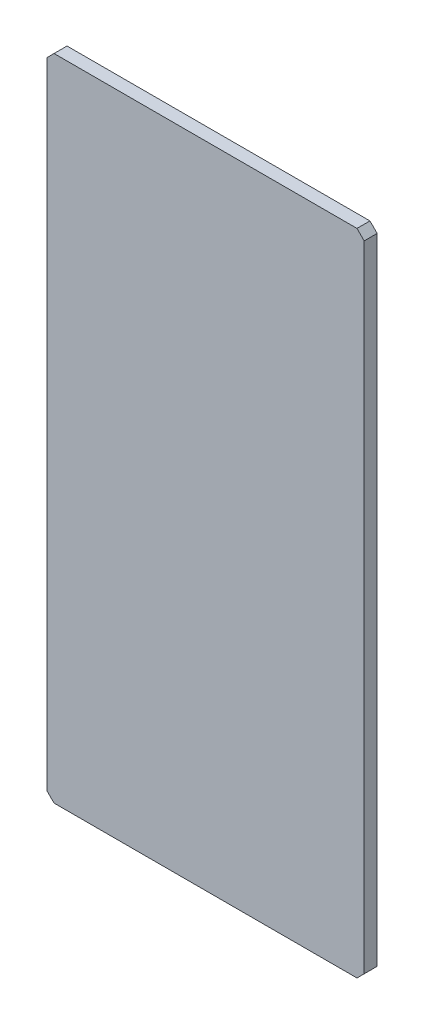
ISO-10303-21;
HEADER;
FILE_DESCRIPTION(('STEP AP214'),'2;1');
FILE_NAME('part.step','',(''),(''),'','','');
FILE_SCHEMA(('AUTOMOTIVE_DESIGN { 1 0 10303 214 1 1 1 1 }'));
ENDSEC;
DATA;
#1=APPLICATION_CONTEXT('core data for automotive mechanical design processes');
#2=APPLICATION_PROTOCOL_DEFINITION('international standard','automotive_design',2000,#1);
#3=PRODUCT_CONTEXT('',#1,'mechanical');
#4=PRODUCT('Part','Part','',(#3));
#5=PRODUCT_RELATED_PRODUCT_CATEGORY('part','',(#4));
#6=PRODUCT_DEFINITION_FORMATION('','',#4);
#7=PRODUCT_DEFINITION_CONTEXT('part definition',#1,'design');
#8=PRODUCT_DEFINITION('design','',#6,#7);
#9=PRODUCT_DEFINITION_SHAPE('','',#8);
#10=(LENGTH_UNIT() NAMED_UNIT(*) SI_UNIT(.MILLI.,.METRE.));
#11=(NAMED_UNIT(*) PLANE_ANGLE_UNIT() SI_UNIT($,.RADIAN.));
#12=(NAMED_UNIT(*) SI_UNIT($,.STERADIAN.) SOLID_ANGLE_UNIT());
#13=UNCERTAINTY_MEASURE_WITH_UNIT(LENGTH_MEASURE(1.E-05),#10,'distance_accuracy_value','');
#14=(GEOMETRIC_REPRESENTATION_CONTEXT(3) GLOBAL_UNCERTAINTY_ASSIGNED_CONTEXT((#13)) GLOBAL_UNIT_ASSIGNED_CONTEXT((#10,
#11,#12)) REPRESENTATION_CONTEXT('',''));
#15=CARTESIAN_POINT('',(0.,0.,0.));
#16=DIRECTION('',(0.,0.,1.));
#17=DIRECTION('',(1.,0.,0.));
#18=AXIS2_PLACEMENT_3D('',#15,#16,#17);
#19=CARTESIAN_POINT('',(1.61648472385423E-12,343.,-83.0000000000048));
#20=DIRECTION('',(0.,0.,-1.));
#21=DIRECTION('',(-1.,0.,0.));
#22=AXIS2_PLACEMENT_3D('',#19,#20,#21);
#23=PLANE('',#22);
#24=DIRECTION('',(0.707106781186547,-0.707106781186548,0.));
#25=VECTOR('',#24,1.);
#26=CARTESIAN_POINT('',(-214.999999999998,-4.99999999999926,-83.000000000023));
#27=LINE('',#26,#25);
#28=CARTESIAN_POINT('',(-219.999999999998,1.86283280467771E-13,-83.000000000023));
#29=VERTEX_POINT('',#28);
#30=CARTESIAN_POINT('',(-209.999999999998,-9.99999999999993,-83.0000000000224));
#31=VERTEX_POINT('',#30);
#32=EDGE_CURVE('E113',#29,#31,#27,.T.);
#33=ORIENTED_EDGE('',*,*,#32,.F.);
#34=DIRECTION('',(0.,1.,0.));
#35=VECTOR('',#34,1.);
#36=CARTESIAN_POINT('',(-219.999999999997,40.,-83.000000000023));
#37=LINE('',#36,#35);
#38=CARTESIAN_POINT('',(-219.999999999998,880.,-83.0000000000228));
#39=VERTEX_POINT('',#38);
#40=EDGE_CURVE('E117',#39,#29,#37,.F.);
#41=ORIENTED_EDGE('',*,*,#40,.F.);
#42=DIRECTION('',(-0.707106781186548,-0.707106781186548,0.));
#43=VECTOR('',#42,1.);
#44=CARTESIAN_POINT('',(-214.999999999998,884.999999999999,-83.0000000000222));
#45=LINE('',#44,#43);
#46=CARTESIAN_POINT('',(-209.999999999998,890.,-83.0000000000135));
#47=VERTEX_POINT('',#46);
#48=EDGE_CURVE('E94',#47,#39,#45,.T.);
#49=ORIENTED_EDGE('',*,*,#48,.F.);
#50=DIRECTION('',(1.,0.,0.));
#51=VECTOR('',#50,1.);
#52=CARTESIAN_POINT('',(-57.4999999999997,890.,-82.9999999999874));
#53=LINE('',#52,#51);
#54=CARTESIAN_POINT('',(210.000000000001,890.,-82.9999999999872));
#55=VERTEX_POINT('',#54);
#56=EDGE_CURVE('E19',#55,#47,#53,.F.);
#57=ORIENTED_EDGE('',*,*,#56,.F.);
#58=DIRECTION('',(-0.707106781186548,0.707106781186548,0.));
#59=VECTOR('',#58,1.);
#60=CARTESIAN_POINT('',(215.000000000001,885.000000000001,-82.9999999999865));
#61=LINE('',#60,#59);
#62=CARTESIAN_POINT('',(220.000000000001,880.,-82.9999999999866));
#63=VERTEX_POINT('',#62);
#64=EDGE_CURVE('E82',#63,#55,#61,.T.);
#65=ORIENTED_EDGE('',*,*,#64,.F.);
#66=DIRECTION('',(0.,1.,0.));
#67=VECTOR('',#66,1.);
#68=CARTESIAN_POINT('',(220.000000000002,648.,-82.9999999999865));
#69=LINE('',#68,#67);
#70=CARTESIAN_POINT('',(220.000000000001,-1.00956569493163E-13,-82.9999999999868));
#71=VERTEX_POINT('',#70);
#72=EDGE_CURVE('E77',#71,#63,#69,.T.);
#73=ORIENTED_EDGE('',*,*,#72,.F.);
#74=DIRECTION('',(0.707106781186547,0.707106781186548,0.));
#75=VECTOR('',#74,1.);
#76=CARTESIAN_POINT('',(215.000000000001,-5.00000000000075,-82.9999999999874));
#77=LINE('',#76,#75);
#78=CARTESIAN_POINT('',(210.000000000001,-10.0000000000002,-82.9999999999961));
#79=VERTEX_POINT('',#78);
#80=EDGE_CURVE('E105',#79,#71,#77,.T.);
#81=ORIENTED_EDGE('',*,*,#80,.F.);
#82=DIRECTION('',(1.,0.,0.));
#83=VECTOR('',#82,1.);
#84=CARTESIAN_POINT('',(57.5,-10.,-83.0000000000222));
#85=LINE('',#84,#83);
#86=EDGE_CURVE('E109',#31,#79,#85,.T.);
#87=ORIENTED_EDGE('',*,*,#86,.F.);
#88=EDGE_LOOP('',(#33,#41,#49,#57,#65,#73,#81,#87));
#89=FACE_BOUND('',#88,.T.);
#90=ADVANCED_FACE('F16',(#89),#23,.T.);
#91=CARTESIAN_POINT('',(-57.4999999999997,890.,-65.0000000000095));
#92=DIRECTION('',(0.,1.,0.));
#93=DIRECTION('',(0.,0.,1.));
#94=AXIS2_PLACEMENT_3D('',#91,#92,#93);
#95=PLANE('',#94);
#96=DIRECTION('',(0.,0.,1.));
#97=VECTOR('',#96,1.);
#98=CARTESIAN_POINT('',(210.,889.999999999999,-64.9999999999869));
#99=LINE('',#98,#97);
#100=CARTESIAN_POINT('',(210.,890.,-65.0000000000048));
#101=VERTEX_POINT('',#100);
#102=EDGE_CURVE('E87',#55,#101,#99,.T.);
#103=ORIENTED_EDGE('',*,*,#102,.F.);
#104=ORIENTED_EDGE('',*,*,#56,.T.);
#105=DIRECTION('',(0.,0.,1.));
#106=VECTOR('',#105,1.);
#107=CARTESIAN_POINT('',(-209.999999999999,890.,-65.0000000000226));
#108=LINE('',#107,#106);
#109=CARTESIAN_POINT('',(-209.999999999999,890.,-65.0000000000224));
#110=VERTEX_POINT('',#109);
#111=EDGE_CURVE('E123',#110,#47,#108,.F.);
#112=ORIENTED_EDGE('',*,*,#111,.F.);
#113=DIRECTION('',(-1.,0.,0.));
#114=VECTOR('',#113,1.);
#115=CARTESIAN_POINT('',(1.23572649697815E-13,890.,-65.0000000000048));
#116=LINE('',#115,#114);
#117=EDGE_CURVE('E100',#110,#101,#116,.F.);
#118=ORIENTED_EDGE('',*,*,#117,.T.);
#119=EDGE_LOOP('',(#103,#104,#112,#118));
#120=FACE_BOUND('',#119,.T.);
#121=ADVANCED_FACE('F99',(#120),#95,.T.);
#122=CARTESIAN_POINT('',(215.,885.,-64.9999999999869));
#123=DIRECTION('',(0.707106781186548,0.707106781186548,0.));
#124=DIRECTION('',(-0.707106781186548,0.707106781186548,0.));
#125=AXIS2_PLACEMENT_3D('',#122,#123,#124);
#126=PLANE('',#125);
#127=DIRECTION('',(0.707106781186547,-0.707106781186547,0.));
#128=VECTOR('',#127,1.);
#129=CARTESIAN_POINT('',(210.,890.,-64.9999999999874));
#130=LINE('',#129,#128);
#131=CARTESIAN_POINT('',(220.,880.,-64.999999999987));
#132=VERTEX_POINT('',#131);
#133=EDGE_CURVE('E126',#101,#132,#130,.T.);
#134=ORIENTED_EDGE('',*,*,#133,.T.);
#135=DIRECTION('',(0.,0.,-1.));
#136=VECTOR('',#135,1.);
#137=CARTESIAN_POINT('',(220.,880.,-64.9999999999865));
#138=LINE('',#137,#136);
#139=EDGE_CURVE('E89',#63,#132,#138,.F.);
#140=ORIENTED_EDGE('',*,*,#139,.F.);
#141=ORIENTED_EDGE('',*,*,#64,.T.);
#142=ORIENTED_EDGE('',*,*,#102,.T.);
#143=EDGE_LOOP('',(#134,#140,#141,#142));
#144=FACE_BOUND('',#143,.T.);
#145=ADVANCED_FACE('F85',(#144),#126,.T.);
#146=CARTESIAN_POINT('',(220.,648.,-64.9999999999865));
#147=DIRECTION('',(1.,0.,0.));
#148=DIRECTION('',(0.,0.,-1.));
#149=AXIS2_PLACEMENT_3D('',#146,#147,#148);
#150=PLANE('',#149);
#151=ORIENTED_EDGE('',*,*,#139,.T.);
#152=DIRECTION('',(0.,1.,0.));
#153=VECTOR('',#152,1.);
#154=CARTESIAN_POINT('',(220.,343.,-64.9999999999866));
#155=LINE('',#154,#153);
#156=CARTESIAN_POINT('',(220.,1.06577073555327E-13,-64.9999999999865));
#157=VERTEX_POINT('',#156);
#158=EDGE_CURVE('E128',#132,#157,#155,.F.);
#159=ORIENTED_EDGE('',*,*,#158,.T.);
#160=DIRECTION('',(0.,0.,1.));
#161=VECTOR('',#160,1.);
#162=CARTESIAN_POINT('',(220.000000000001,5.09141340199193E-13,-64.9999999999869));
#163=LINE('',#162,#161);
#164=EDGE_CURVE('E107',#71,#157,#163,.T.);
#165=ORIENTED_EDGE('',*,*,#164,.F.);
#166=ORIENTED_EDGE('',*,*,#72,.T.);
#167=EDGE_LOOP('',(#151,#159,#165,#166));
#168=FACE_BOUND('',#167,.T.);
#169=ADVANCED_FACE('F161',(#168),#150,.T.);
#170=CARTESIAN_POINT('',(215.,-5.,-64.9999999999869));
#171=DIRECTION('',(0.707106781186548,-0.707106781186547,0.));
#172=DIRECTION('',(0.707106781186547,0.707106781186548,0.));
#173=AXIS2_PLACEMENT_3D('',#170,#171,#172);
#174=PLANE('',#173);
#175=DIRECTION('',(-0.707106781186547,-0.707106781186547,0.));
#176=VECTOR('',#175,1.);
#177=CARTESIAN_POINT('',(220.,0.,-64.9999999999866));
#178=LINE('',#177,#176);
#179=CARTESIAN_POINT('',(210.,-10.,-64.999999999987));
#180=VERTEX_POINT('',#179);
#181=EDGE_CURVE('E131',#157,#180,#178,.T.);
#182=ORIENTED_EDGE('',*,*,#181,.T.);
#183=DIRECTION('',(0.,0.,-1.));
#184=VECTOR('',#183,1.);
#185=CARTESIAN_POINT('',(210.000000000001,-10.,-65.));
#186=LINE('',#185,#184);
#187=EDGE_CURVE('E111',#79,#180,#186,.F.);
#188=ORIENTED_EDGE('',*,*,#187,.F.);
#189=ORIENTED_EDGE('',*,*,#80,.T.);
#190=ORIENTED_EDGE('',*,*,#164,.T.);
#191=EDGE_LOOP('',(#182,#188,#189,#190));
#192=FACE_BOUND('',#191,.T.);
#193=ADVANCED_FACE('F160',(#192),#174,.T.);
#194=CARTESIAN_POINT('',(57.5,-10.,-65.));
#195=DIRECTION('',(0.,-1.,0.));
#196=DIRECTION('',(0.,0.,-1.));
#197=AXIS2_PLACEMENT_3D('',#194,#195,#196);
#198=PLANE('',#197);
#199=ORIENTED_EDGE('',*,*,#187,.T.);
#200=DIRECTION('',(-1.,0.,0.));
#201=VECTOR('',#200,1.);
#202=CARTESIAN_POINT('',(1.23572649697815E-13,-10.,-65.0000000000048));
#203=LINE('',#202,#201);
#204=CARTESIAN_POINT('',(-209.999999999999,-10.0000000000001,-65.0000000000048));
#205=VERTEX_POINT('',#204);
#206=EDGE_CURVE('E134',#180,#205,#203,.T.);
#207=ORIENTED_EDGE('',*,*,#206,.T.);
#208=DIRECTION('',(0.,0.,1.));
#209=VECTOR('',#208,1.);
#210=CARTESIAN_POINT('',(-209.999999999999,-10.0000000000005,-65.0000000000226));
#211=LINE('',#210,#209);
#212=EDGE_CURVE('E115',#31,#205,#211,.T.);
#213=ORIENTED_EDGE('',*,*,#212,.F.);
#214=ORIENTED_EDGE('',*,*,#86,.T.);
#215=EDGE_LOOP('',(#199,#207,#213,#214));
#216=FACE_BOUND('',#215,.T.);
#217=ADVANCED_FACE('F154',(#216),#198,.T.);
#218=CARTESIAN_POINT('',(-214.999999999999,-5.00000000000001,-65.0000000000226));
#219=DIRECTION('',(-0.707106781186548,-0.707106781186547,0.));
#220=DIRECTION('',(0.707106781186547,-0.707106781186548,0.));
#221=AXIS2_PLACEMENT_3D('',#218,#219,#220);
#222=PLANE('',#221);
#223=ORIENTED_EDGE('',*,*,#32,.T.);
#224=ORIENTED_EDGE('',*,*,#212,.T.);
#225=DIRECTION('',(-0.707106781186546,0.707106781186548,0.));
#226=VECTOR('',#225,1.);
#227=CARTESIAN_POINT('',(-209.999999999999,-10.,-65.0000000000222));
#228=LINE('',#227,#226);
#229=CARTESIAN_POINT('',(-219.999999999999,0.,-65.0000000000226));
#230=VERTEX_POINT('',#229);
#231=EDGE_CURVE('E137',#205,#230,#228,.T.);
#232=ORIENTED_EDGE('',*,*,#231,.T.);
#233=DIRECTION('',(0.,0.,1.));
#234=VECTOR('',#233,1.);
#235=CARTESIAN_POINT('',(-219.999999999999,0.,-65.000000000023));
#236=LINE('',#235,#234);
#237=EDGE_CURVE('E119',#29,#230,#236,.T.);
#238=ORIENTED_EDGE('',*,*,#237,.F.);
#239=EDGE_LOOP('',(#223,#224,#232,#238));
#240=FACE_BOUND('',#239,.T.);
#241=ADVANCED_FACE('F150',(#240),#222,.T.);
#242=CARTESIAN_POINT('',(-219.999999999999,40.,-65.000000000023));
#243=DIRECTION('',(-1.,0.,0.));
#244=DIRECTION('',(0.,0.,1.));
#245=AXIS2_PLACEMENT_3D('',#242,#243,#244);
#246=PLANE('',#245);
#247=ORIENTED_EDGE('',*,*,#237,.T.);
#248=DIRECTION('',(0.,1.,0.));
#249=VECTOR('',#248,1.);
#250=CARTESIAN_POINT('',(-219.999999999999,343.,-65.000000000023));
#251=LINE('',#250,#249);
#252=CARTESIAN_POINT('',(-219.999999999999,880.,-65.000000000023));
#253=VERTEX_POINT('',#252);
#254=EDGE_CURVE('E25',#230,#253,#251,.T.);
#255=ORIENTED_EDGE('',*,*,#254,.T.);
#256=DIRECTION('',(0.,0.,1.));
#257=VECTOR('',#256,1.);
#258=CARTESIAN_POINT('',(-219.999999999998,880.000000000001,-65.0000000000226));
#259=LINE('',#258,#257);
#260=EDGE_CURVE('E33',#39,#253,#259,.T.);
#261=ORIENTED_EDGE('',*,*,#260,.F.);
#262=ORIENTED_EDGE('',*,*,#40,.T.);
#263=EDGE_LOOP('',(#247,#255,#261,#262));
#264=FACE_BOUND('',#263,.T.);
#265=ADVANCED_FACE('F143',(#264),#246,.T.);
#266=CARTESIAN_POINT('',(-214.999999999999,885.,-65.0000000000226));
#267=DIRECTION('',(-0.707106781186548,0.707106781186548,0.));
#268=DIRECTION('',(-0.707106781186548,-0.707106781186548,0.));
#269=AXIS2_PLACEMENT_3D('',#266,#267,#268);
#270=PLANE('',#269);
#271=DIRECTION('',(0.707106781186546,0.707106781186548,0.));
#272=VECTOR('',#271,1.);
#273=CARTESIAN_POINT('',(-219.999999999999,880.,-65.000000000023));
#274=LINE('',#273,#272);
#275=EDGE_CURVE('E11',#253,#110,#274,.T.);
#276=ORIENTED_EDGE('',*,*,#275,.T.);
#277=ORIENTED_EDGE('',*,*,#111,.T.);
#278=ORIENTED_EDGE('',*,*,#48,.T.);
#279=ORIENTED_EDGE('',*,*,#260,.T.);
#280=EDGE_LOOP('',(#276,#277,#278,#279));
#281=FACE_BOUND('',#280,.T.);
#282=ADVANCED_FACE('F162',(#281),#270,.T.);
#283=CARTESIAN_POINT('',(1.23572649697815E-13,343.,-65.0000000000048));
#284=DIRECTION('',(0.,0.,-1.));
#285=DIRECTION('',(-1.,0.,0.));
#286=AXIS2_PLACEMENT_3D('',#283,#284,#285);
#287=PLANE('',#286);
#288=ORIENTED_EDGE('',*,*,#254,.F.);
#289=ORIENTED_EDGE('',*,*,#231,.F.);
#290=ORIENTED_EDGE('',*,*,#206,.F.);
#291=ORIENTED_EDGE('',*,*,#181,.F.);
#292=ORIENTED_EDGE('',*,*,#158,.F.);
#293=ORIENTED_EDGE('',*,*,#133,.F.);
#294=ORIENTED_EDGE('',*,*,#117,.F.);
#295=ORIENTED_EDGE('',*,*,#275,.F.);
#296=EDGE_LOOP('',(#288,#289,#290,#291,#292,#293,#294,#295));
#297=FACE_BOUND('',#296,.T.);
#298=ADVANCED_FACE('F147',(#297),#287,.F.);
#299=CLOSED_SHELL('',(#90,#121,#145,#169,#193,#217,#241,#265,#282,#298));
#300=MANIFOLD_SOLID_BREP('B1',#299);
#301=ADVANCED_BREP_SHAPE_REPRESENTATION('',(#18,#300),#14);
#302=SHAPE_DEFINITION_REPRESENTATION(#9,#301);
ENDSEC;
END-ISO-10303-21;
